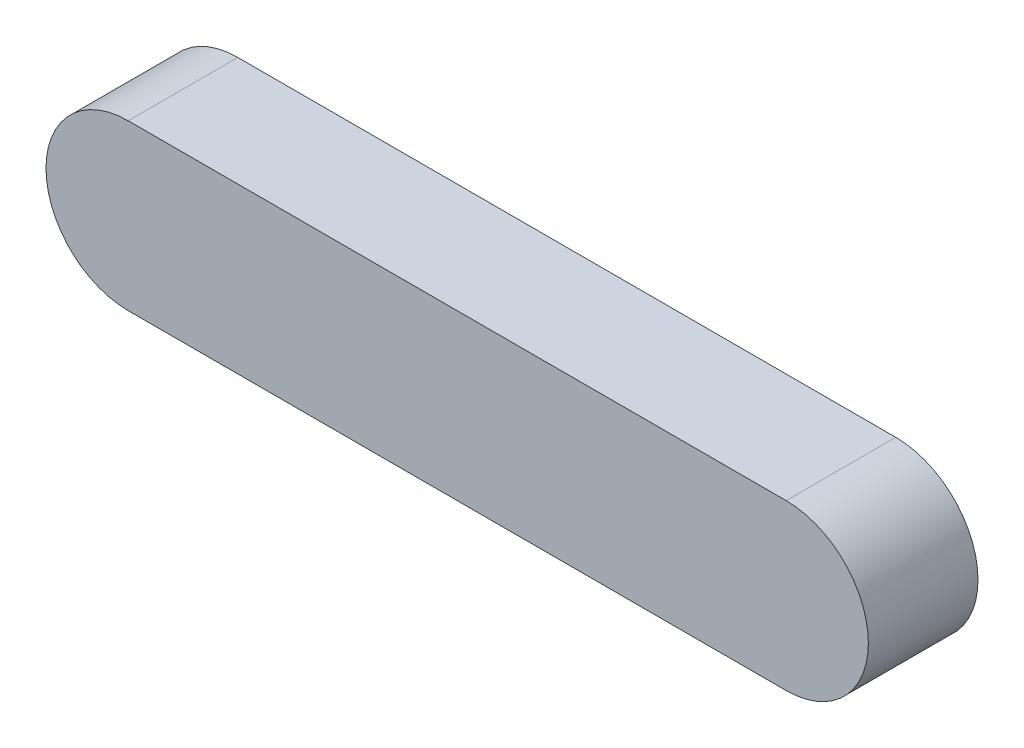
ISO-10303-21;
HEADER;
FILE_DESCRIPTION(('STEP AP214'),'2;1');
FILE_NAME('part.step','',(''),(''),'','','');
FILE_SCHEMA(('AUTOMOTIVE_DESIGN { 1 0 10303 214 1 1 1 1 }'));
ENDSEC;
DATA;
#1=APPLICATION_CONTEXT('core data for automotive mechanical design processes');
#2=APPLICATION_PROTOCOL_DEFINITION('international standard','automotive_design',2000,#1);
#3=PRODUCT_CONTEXT('',#1,'mechanical');
#4=PRODUCT('Part','Part','',(#3));
#5=PRODUCT_RELATED_PRODUCT_CATEGORY('part','',(#4));
#6=PRODUCT_DEFINITION_FORMATION('','',#4);
#7=PRODUCT_DEFINITION_CONTEXT('part definition',#1,'design');
#8=PRODUCT_DEFINITION('design','',#6,#7);
#9=PRODUCT_DEFINITION_SHAPE('','',#8);
#10=(LENGTH_UNIT() NAMED_UNIT(*) SI_UNIT(.MILLI.,.METRE.));
#11=(NAMED_UNIT(*) PLANE_ANGLE_UNIT() SI_UNIT($,.RADIAN.));
#12=(NAMED_UNIT(*) SI_UNIT($,.STERADIAN.) SOLID_ANGLE_UNIT());
#13=UNCERTAINTY_MEASURE_WITH_UNIT(LENGTH_MEASURE(1.E-05),#10,'distance_accuracy_value','');
#14=(GEOMETRIC_REPRESENTATION_CONTEXT(3) GLOBAL_UNCERTAINTY_ASSIGNED_CONTEXT((#13)) GLOBAL_UNIT_ASSIGNED_CONTEXT((#10,
#11,#12)) REPRESENTATION_CONTEXT('',''));
#15=CARTESIAN_POINT('',(0.,0.,0.));
#16=DIRECTION('',(0.,0.,1.));
#17=DIRECTION('',(1.,0.,0.));
#18=AXIS2_PLACEMENT_3D('',#15,#16,#17);
#19=CARTESIAN_POINT('',(0.,0.,10.));
#20=DIRECTION('',(0.,0.,-1.));
#21=DIRECTION('',(-1.,0.,0.));
#22=AXIS2_PLACEMENT_3D('',#19,#20,#21);
#23=CYLINDRICAL_SURFACE('',#22,7.5);
#24=CARTESIAN_POINT('',(0.,0.,0.));
#25=DIRECTION('',(0.,0.,1.));
#26=DIRECTION('',(1.,0.,0.));
#27=AXIS2_PLACEMENT_3D('',#24,#25,#26);
#28=CIRCLE('',#27,7.5);
#29=CARTESIAN_POINT('',(0.,-7.5,0.));
#30=VERTEX_POINT('',#29);
#31=CARTESIAN_POINT('',(0.,7.5,0.));
#32=VERTEX_POINT('',#31);
#33=EDGE_CURVE('E97',#30,#32,#28,.T.);
#34=ORIENTED_EDGE('',*,*,#33,.T.);
#35=DIRECTION('',(0.,0.,-1.));
#36=VECTOR('',#35,1.);
#37=CARTESIAN_POINT('',(0.,7.5,10.));
#38=LINE('',#37,#36);
#39=CARTESIAN_POINT('',(0.,7.5,10.));
#40=VERTEX_POINT('',#39);
#41=EDGE_CURVE('E11',#40,#32,#38,.T.);
#42=ORIENTED_EDGE('',*,*,#41,.F.);
#43=CARTESIAN_POINT('',(0.,0.,10.));
#44=DIRECTION('',(0.,0.,1.));
#45=DIRECTION('',(1.,0.,0.));
#46=AXIS2_PLACEMENT_3D('',#43,#44,#45);
#47=CIRCLE('',#46,7.5);
#48=CARTESIAN_POINT('',(0.,-7.5,10.));
#49=VERTEX_POINT('',#48);
#50=EDGE_CURVE('E85',#49,#40,#47,.T.);
#51=ORIENTED_EDGE('',*,*,#50,.F.);
#52=DIRECTION('',(0.,0.,-1.));
#53=VECTOR('',#52,1.);
#54=CARTESIAN_POINT('',(0.,-7.5,10.));
#55=LINE('',#54,#53);
#56=EDGE_CURVE('E93',#49,#30,#55,.T.);
#57=ORIENTED_EDGE('',*,*,#56,.T.);
#58=EDGE_LOOP('',(#34,#42,#51,#57));
#59=FACE_BOUND('',#58,.T.);
#60=ADVANCED_FACE('F34',(#59),#23,.T.);
#61=CARTESIAN_POINT('',(0.,7.5,10.));
#62=DIRECTION('',(0.,-1.,0.));
#63=DIRECTION('',(1.,0.,0.));
#64=AXIS2_PLACEMENT_3D('',#61,#62,#63);
#65=PLANE('',#64);
#66=DIRECTION('',(-1.,0.,0.));
#67=VECTOR('',#66,1.);
#68=CARTESIAN_POINT('',(0.,7.5,0.));
#69=LINE('',#68,#67);
#70=CARTESIAN_POINT('',(-60.,7.49999999999999,0.));
#71=VERTEX_POINT('',#70);
#72=EDGE_CURVE('E89',#32,#71,#69,.T.);
#73=ORIENTED_EDGE('',*,*,#72,.T.);
#74=DIRECTION('',(0.,0.,-1.));
#75=VECTOR('',#74,1.);
#76=CARTESIAN_POINT('',(-60.,7.49999999999999,10.));
#77=LINE('',#76,#75);
#78=CARTESIAN_POINT('',(-60.,7.49999999999999,10.));
#79=VERTEX_POINT('',#78);
#80=EDGE_CURVE('E42',#79,#71,#77,.T.);
#81=ORIENTED_EDGE('',*,*,#80,.F.);
#82=DIRECTION('',(-1.,0.,0.));
#83=VECTOR('',#82,1.);
#84=CARTESIAN_POINT('',(0.,7.5,10.));
#85=LINE('',#84,#83);
#86=EDGE_CURVE('E80',#40,#79,#85,.T.);
#87=ORIENTED_EDGE('',*,*,#86,.F.);
#88=ORIENTED_EDGE('',*,*,#41,.T.);
#89=EDGE_LOOP('',(#73,#81,#87,#88));
#90=FACE_BOUND('',#89,.T.);
#91=ADVANCED_FACE('F88',(#90),#65,.F.);
#92=CARTESIAN_POINT('',(-60.,0.,10.));
#93=DIRECTION('',(0.,0.,-1.));
#94=DIRECTION('',(-1.,0.,0.));
#95=AXIS2_PLACEMENT_3D('',#92,#93,#94);
#96=CYLINDRICAL_SURFACE('',#95,7.5);
#97=CARTESIAN_POINT('',(-60.,0.,0.));
#98=DIRECTION('',(0.,0.,1.));
#99=DIRECTION('',(1.,0.,0.));
#100=AXIS2_PLACEMENT_3D('',#97,#98,#99);
#101=CIRCLE('',#100,7.5);
#102=CARTESIAN_POINT('',(-60.,-7.50000000000001,0.));
#103=VERTEX_POINT('',#102);
#104=EDGE_CURVE('E67',#71,#103,#101,.T.);
#105=ORIENTED_EDGE('',*,*,#104,.T.);
#106=DIRECTION('',(0.,0.,-1.));
#107=VECTOR('',#106,1.);
#108=CARTESIAN_POINT('',(-60.,-7.50000000000001,10.));
#109=LINE('',#108,#107);
#110=CARTESIAN_POINT('',(-60.,-7.50000000000001,10.));
#111=VERTEX_POINT('',#110);
#112=EDGE_CURVE('E90',#111,#103,#109,.T.);
#113=ORIENTED_EDGE('',*,*,#112,.F.);
#114=CARTESIAN_POINT('',(-60.,0.,10.));
#115=DIRECTION('',(0.,0.,1.));
#116=DIRECTION('',(1.,0.,0.));
#117=AXIS2_PLACEMENT_3D('',#114,#115,#116);
#118=CIRCLE('',#117,7.5);
#119=EDGE_CURVE('E83',#79,#111,#118,.T.);
#120=ORIENTED_EDGE('',*,*,#119,.F.);
#121=ORIENTED_EDGE('',*,*,#80,.T.);
#122=EDGE_LOOP('',(#105,#113,#120,#121));
#123=FACE_BOUND('',#122,.T.);
#124=ADVANCED_FACE('F91',(#123),#96,.T.);
#125=CARTESIAN_POINT('',(0.,-7.5,10.));
#126=DIRECTION('',(0.,1.,0.));
#127=DIRECTION('',(-1.,0.,0.));
#128=AXIS2_PLACEMENT_3D('',#125,#126,#127);
#129=PLANE('',#128);
#130=DIRECTION('',(1.,0.,0.));
#131=VECTOR('',#130,1.);
#132=CARTESIAN_POINT('',(0.,-7.5,0.));
#133=LINE('',#132,#131);
#134=EDGE_CURVE('E73',#103,#30,#133,.T.);
#135=ORIENTED_EDGE('',*,*,#134,.T.);
#136=ORIENTED_EDGE('',*,*,#56,.F.);
#137=DIRECTION('',(1.,0.,0.));
#138=VECTOR('',#137,1.);
#139=CARTESIAN_POINT('',(0.,-7.5,10.));
#140=LINE('',#139,#138);
#141=EDGE_CURVE('E50',#111,#49,#140,.T.);
#142=ORIENTED_EDGE('',*,*,#141,.F.);
#143=ORIENTED_EDGE('',*,*,#112,.T.);
#144=EDGE_LOOP('',(#135,#136,#142,#143));
#145=FACE_BOUND('',#144,.T.);
#146=ADVANCED_FACE('F104',(#145),#129,.F.);
#147=CARTESIAN_POINT('',(0.,0.,10.));
#148=DIRECTION('',(0.,0.,1.));
#149=DIRECTION('',(1.,0.,0.));
#150=AXIS2_PLACEMENT_3D('',#147,#148,#149);
#151=PLANE('',#150);
#152=ORIENTED_EDGE('',*,*,#50,.T.);
#153=ORIENTED_EDGE('',*,*,#86,.T.);
#154=ORIENTED_EDGE('',*,*,#119,.T.);
#155=ORIENTED_EDGE('',*,*,#141,.T.);
#156=EDGE_LOOP('',(#152,#153,#154,#155));
#157=FACE_BOUND('',#156,.T.);
#158=ADVANCED_FACE('F81',(#157),#151,.T.);
#159=CARTESIAN_POINT('',(0.,0.,0.));
#160=DIRECTION('',(0.,0.,1.));
#161=DIRECTION('',(1.,0.,0.));
#162=AXIS2_PLACEMENT_3D('',#159,#160,#161);
#163=PLANE('',#162);
#164=ORIENTED_EDGE('',*,*,#33,.F.);
#165=ORIENTED_EDGE('',*,*,#134,.F.);
#166=ORIENTED_EDGE('',*,*,#104,.F.);
#167=ORIENTED_EDGE('',*,*,#72,.F.);
#168=EDGE_LOOP('',(#164,#165,#166,#167));
#169=FACE_BOUND('',#168,.T.);
#170=ADVANCED_FACE('F107',(#169),#163,.F.);
#171=CLOSED_SHELL('',(#60,#91,#124,#146,#158,#170));
#172=MANIFOLD_SOLID_BREP('B2',#171);
#173=ADVANCED_BREP_SHAPE_REPRESENTATION('',(#18,#172),#14);
#174=SHAPE_DEFINITION_REPRESENTATION(#9,#173);
ENDSEC;
END-ISO-10303-21;
